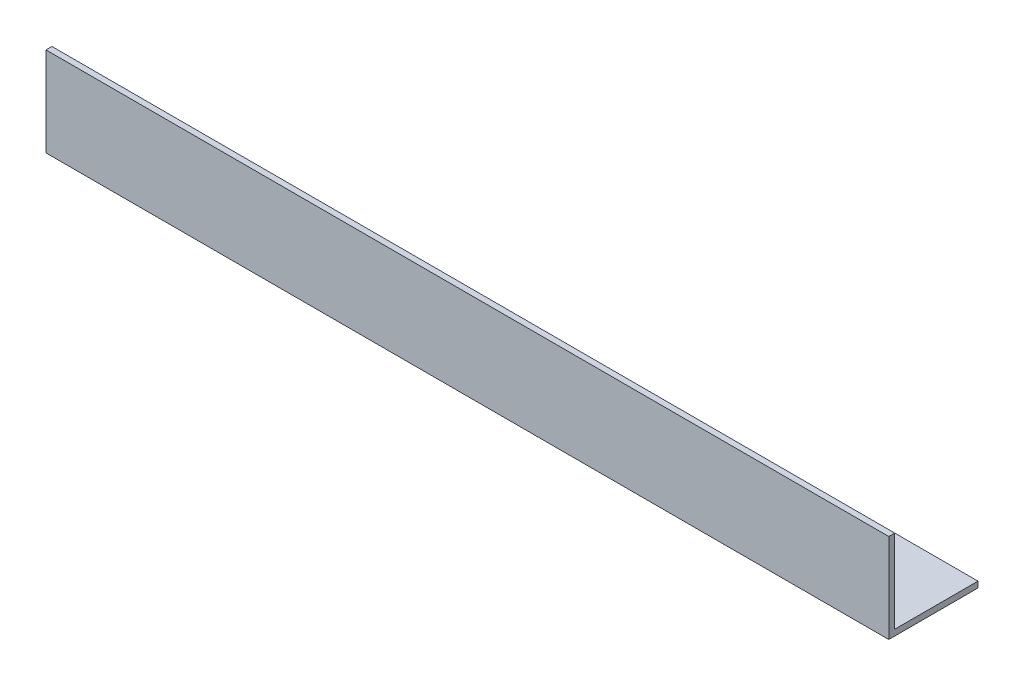
ISO-10303-21;
HEADER;
FILE_DESCRIPTION(('STEP AP214'),'2;1');
FILE_NAME('part.step','',(''),(''),'','','');
FILE_SCHEMA(('AUTOMOTIVE_DESIGN { 1 0 10303 214 1 1 1 1 }'));
ENDSEC;
DATA;
#1=APPLICATION_CONTEXT('core data for automotive mechanical design processes');
#2=APPLICATION_PROTOCOL_DEFINITION('international standard','automotive_design',2000,#1);
#3=PRODUCT_CONTEXT('',#1,'mechanical');
#4=PRODUCT('Part','Part','',(#3));
#5=PRODUCT_RELATED_PRODUCT_CATEGORY('part','',(#4));
#6=PRODUCT_DEFINITION_FORMATION('','',#4);
#7=PRODUCT_DEFINITION_CONTEXT('part definition',#1,'design');
#8=PRODUCT_DEFINITION('design','',#6,#7);
#9=PRODUCT_DEFINITION_SHAPE('','',#8);
#10=(LENGTH_UNIT() NAMED_UNIT(*) SI_UNIT(.MILLI.,.METRE.));
#11=(NAMED_UNIT(*) PLANE_ANGLE_UNIT() SI_UNIT($,.RADIAN.));
#12=(NAMED_UNIT(*) SI_UNIT($,.STERADIAN.) SOLID_ANGLE_UNIT());
#13=UNCERTAINTY_MEASURE_WITH_UNIT(LENGTH_MEASURE(1.E-05),#10,'distance_accuracy_value','');
#14=(GEOMETRIC_REPRESENTATION_CONTEXT(3) GLOBAL_UNCERTAINTY_ASSIGNED_CONTEXT((#13)) GLOBAL_UNIT_ASSIGNED_CONTEXT((#10,
#11,#12)) REPRESENTATION_CONTEXT('',''));
#15=CARTESIAN_POINT('',(0.,0.,0.));
#16=DIRECTION('',(0.,0.,1.));
#17=DIRECTION('',(1.,0.,0.));
#18=AXIS2_PLACEMENT_3D('',#15,#16,#17);
#19=CARTESIAN_POINT('',(425.,0.,0.));
#20=DIRECTION('',(0.,1.,0.));
#21=DIRECTION('',(0.,0.,1.));
#22=AXIS2_PLACEMENT_3D('',#19,#20,#21);
#23=PLANE('',#22);
#24=DIRECTION('',(0.,0.,-1.));
#25=VECTOR('',#24,1.);
#26=CARTESIAN_POINT('',(0.,0.,0.));
#27=LINE('',#26,#25);
#28=CARTESIAN_POINT('',(0.,0.,0.));
#29=VERTEX_POINT('',#28);
#30=CARTESIAN_POINT('',(0.,0.,-45.));
#31=VERTEX_POINT('',#30);
#32=EDGE_CURVE('E116',#29,#31,#27,.T.);
#33=ORIENTED_EDGE('',*,*,#32,.T.);
#34=DIRECTION('',(-1.,0.,0.));
#35=VECTOR('',#34,1.);
#36=CARTESIAN_POINT('',(425.,0.,-45.));
#37=LINE('',#36,#35);
#38=CARTESIAN_POINT('',(425.,0.,-45.));
#39=VERTEX_POINT('',#38);
#40=EDGE_CURVE('E11',#39,#31,#37,.T.);
#41=ORIENTED_EDGE('',*,*,#40,.F.);
#42=DIRECTION('',(0.,0.,-1.));
#43=VECTOR('',#42,1.);
#44=CARTESIAN_POINT('',(425.,0.,0.));
#45=LINE('',#44,#43);
#46=CARTESIAN_POINT('',(425.,0.,0.));
#47=VERTEX_POINT('',#46);
#48=EDGE_CURVE('E81',#47,#39,#45,.T.);
#49=ORIENTED_EDGE('',*,*,#48,.F.);
#50=DIRECTION('',(-1.,0.,0.));
#51=VECTOR('',#50,1.);
#52=CARTESIAN_POINT('',(425.,0.,0.));
#53=LINE('',#52,#51);
#54=EDGE_CURVE('E112',#47,#29,#53,.T.);
#55=ORIENTED_EDGE('',*,*,#54,.T.);
#56=EDGE_LOOP('',(#33,#41,#49,#55));
#57=FACE_BOUND('',#56,.T.);
#58=ADVANCED_FACE('F35',(#57),#23,.F.);
#59=CARTESIAN_POINT('',(425.,3.,-45.));
#60=DIRECTION('',(0.,0.,-1.));
#61=DIRECTION('',(-1.,0.,0.));
#62=AXIS2_PLACEMENT_3D('',#59,#60,#61);
#63=PLANE('',#62);
#64=DIRECTION('',(0.,-1.,0.));
#65=VECTOR('',#64,1.);
#66=CARTESIAN_POINT('',(0.,3.,-45.));
#67=LINE('',#66,#65);
#68=CARTESIAN_POINT('',(0.,3.,-45.));
#69=VERTEX_POINT('',#68);
#70=EDGE_CURVE('E119',#69,#31,#67,.T.);
#71=ORIENTED_EDGE('',*,*,#70,.F.);
#72=DIRECTION('',(-1.,0.,0.));
#73=VECTOR('',#72,1.);
#74=CARTESIAN_POINT('',(425.,3.,-45.));
#75=LINE('',#74,#73);
#76=CARTESIAN_POINT('',(425.,3.,-45.));
#77=VERTEX_POINT('',#76);
#78=EDGE_CURVE('E43',#77,#69,#75,.T.);
#79=ORIENTED_EDGE('',*,*,#78,.F.);
#80=DIRECTION('',(0.,-1.,0.));
#81=VECTOR('',#80,1.);
#82=CARTESIAN_POINT('',(425.,3.,-45.));
#83=LINE('',#82,#81);
#84=EDGE_CURVE('E205',#77,#39,#83,.T.);
#85=ORIENTED_EDGE('',*,*,#84,.T.);
#86=ORIENTED_EDGE('',*,*,#40,.T.);
#87=EDGE_LOOP('',(#71,#79,#85,#86));
#88=FACE_BOUND('',#87,.T.);
#89=ADVANCED_FACE('F137',(#88),#63,.T.);
#90=CARTESIAN_POINT('',(425.,3.,0.));
#91=DIRECTION('',(0.,1.,0.));
#92=DIRECTION('',(0.,0.,1.));
#93=AXIS2_PLACEMENT_3D('',#90,#91,#92);
#94=PLANE('',#93);
#95=DIRECTION('',(0.,0.,-1.));
#96=VECTOR('',#95,1.);
#97=CARTESIAN_POINT('',(0.,3.,0.));
#98=LINE('',#97,#96);
#99=CARTESIAN_POINT('',(0.,3.,-3.));
#100=VERTEX_POINT('',#99);
#101=EDGE_CURVE('E122',#100,#69,#98,.T.);
#102=ORIENTED_EDGE('',*,*,#101,.F.);
#103=DIRECTION('',(-1.,0.,0.));
#104=VECTOR('',#103,1.);
#105=CARTESIAN_POINT('',(425.,3.,-3.));
#106=LINE('',#105,#104);
#107=CARTESIAN_POINT('',(425.,3.,-3.));
#108=VERTEX_POINT('',#107);
#109=EDGE_CURVE('E102',#108,#100,#106,.T.);
#110=ORIENTED_EDGE('',*,*,#109,.F.);
#111=DIRECTION('',(0.,0.,-1.));
#112=VECTOR('',#111,1.);
#113=CARTESIAN_POINT('',(425.,3.,0.));
#114=LINE('',#113,#112);
#115=EDGE_CURVE('E108',#108,#77,#114,.T.);
#116=ORIENTED_EDGE('',*,*,#115,.T.);
#117=ORIENTED_EDGE('',*,*,#78,.T.);
#118=EDGE_LOOP('',(#102,#110,#116,#117));
#119=FACE_BOUND('',#118,.T.);
#120=ADVANCED_FACE('F134',(#119),#94,.T.);
#121=CARTESIAN_POINT('',(425.,0.,-3.));
#122=DIRECTION('',(0.,0.,-1.));
#123=DIRECTION('',(-1.,0.,0.));
#124=AXIS2_PLACEMENT_3D('',#121,#122,#123);
#125=PLANE('',#124);
#126=DIRECTION('',(0.,1.,0.));
#127=VECTOR('',#126,1.);
#128=CARTESIAN_POINT('',(0.,0.,-3.));
#129=LINE('',#128,#127);
#130=CARTESIAN_POINT('',(0.,45.,-3.));
#131=VERTEX_POINT('',#130);
#132=EDGE_CURVE('E97',#131,#100,#129,.F.);
#133=ORIENTED_EDGE('',*,*,#132,.F.);
#134=DIRECTION('',(-1.,0.,0.));
#135=VECTOR('',#134,1.);
#136=CARTESIAN_POINT('',(425.,45.,-3.));
#137=LINE('',#136,#135);
#138=CARTESIAN_POINT('',(425.,45.,-3.));
#139=VERTEX_POINT('',#138);
#140=EDGE_CURVE('E92',#139,#131,#137,.T.);
#141=ORIENTED_EDGE('',*,*,#140,.F.);
#142=DIRECTION('',(0.,1.,0.));
#143=VECTOR('',#142,1.);
#144=CARTESIAN_POINT('',(425.,0.,-3.));
#145=LINE('',#144,#143);
#146=EDGE_CURVE('E95',#139,#108,#145,.F.);
#147=ORIENTED_EDGE('',*,*,#146,.T.);
#148=ORIENTED_EDGE('',*,*,#109,.T.);
#149=EDGE_LOOP('',(#133,#141,#147,#148));
#150=FACE_BOUND('',#149,.T.);
#151=ADVANCED_FACE('F94',(#150),#125,.T.);
#152=CARTESIAN_POINT('',(425.,45.,0.));
#153=DIRECTION('',(0.,1.,0.));
#154=DIRECTION('',(0.,0.,1.));
#155=AXIS2_PLACEMENT_3D('',#152,#153,#154);
#156=PLANE('',#155);
#157=DIRECTION('',(0.,0.,-1.));
#158=VECTOR('',#157,1.);
#159=CARTESIAN_POINT('',(0.,45.,0.));
#160=LINE('',#159,#158);
#161=CARTESIAN_POINT('',(0.,45.,0.));
#162=VERTEX_POINT('',#161);
#163=EDGE_CURVE('E126',#162,#131,#160,.T.);
#164=ORIENTED_EDGE('',*,*,#163,.F.);
#165=DIRECTION('',(-1.,0.,0.));
#166=VECTOR('',#165,1.);
#167=CARTESIAN_POINT('',(425.,45.,0.));
#168=LINE('',#167,#166);
#169=CARTESIAN_POINT('',(425.,45.,0.));
#170=VERTEX_POINT('',#169);
#171=EDGE_CURVE('E72',#170,#162,#168,.T.);
#172=ORIENTED_EDGE('',*,*,#171,.F.);
#173=DIRECTION('',(0.,0.,-1.));
#174=VECTOR('',#173,1.);
#175=CARTESIAN_POINT('',(425.,45.,0.));
#176=LINE('',#175,#174);
#177=EDGE_CURVE('E106',#170,#139,#176,.T.);
#178=ORIENTED_EDGE('',*,*,#177,.T.);
#179=ORIENTED_EDGE('',*,*,#140,.T.);
#180=EDGE_LOOP('',(#164,#172,#178,#179));
#181=FACE_BOUND('',#180,.T.);
#182=ADVANCED_FACE('F110',(#181),#156,.T.);
#183=CARTESIAN_POINT('',(425.,0.,0.));
#184=DIRECTION('',(0.,0.,-1.));
#185=DIRECTION('',(-1.,0.,0.));
#186=AXIS2_PLACEMENT_3D('',#183,#184,#185);
#187=PLANE('',#186);
#188=DIRECTION('',(0.,-1.,0.));
#189=VECTOR('',#188,1.);
#190=CARTESIAN_POINT('',(0.,0.,0.));
#191=LINE('',#190,#189);
#192=EDGE_CURVE('E75',#162,#29,#191,.T.);
#193=ORIENTED_EDGE('',*,*,#192,.T.);
#194=ORIENTED_EDGE('',*,*,#54,.F.);
#195=DIRECTION('',(0.,-1.,0.));
#196=VECTOR('',#195,1.);
#197=CARTESIAN_POINT('',(425.,0.,0.));
#198=LINE('',#197,#196);
#199=EDGE_CURVE('E51',#170,#47,#198,.T.);
#200=ORIENTED_EDGE('',*,*,#199,.F.);
#201=ORIENTED_EDGE('',*,*,#171,.T.);
#202=EDGE_LOOP('',(#193,#194,#200,#201));
#203=FACE_BOUND('',#202,.T.);
#204=ADVANCED_FACE('F142',(#203),#187,.F.);
#205=CARTESIAN_POINT('',(425.,0.,0.));
#206=DIRECTION('',(-1.,0.,0.));
#207=DIRECTION('',(0.,0.,1.));
#208=AXIS2_PLACEMENT_3D('',#205,#206,#207);
#209=PLANE('',#208);
#210=ORIENTED_EDGE('',*,*,#48,.T.);
#211=ORIENTED_EDGE('',*,*,#84,.F.);
#212=ORIENTED_EDGE('',*,*,#115,.F.);
#213=ORIENTED_EDGE('',*,*,#146,.F.);
#214=ORIENTED_EDGE('',*,*,#177,.F.);
#215=ORIENTED_EDGE('',*,*,#199,.T.);
#216=EDGE_LOOP('',(#210,#211,#212,#213,#214,#215));
#217=FACE_BOUND('',#216,.T.);
#218=ADVANCED_FACE('F105',(#217),#209,.F.);
#219=CARTESIAN_POINT('',(0.,0.,0.));
#220=DIRECTION('',(-1.,0.,0.));
#221=DIRECTION('',(0.,0.,1.));
#222=AXIS2_PLACEMENT_3D('',#219,#220,#221);
#223=PLANE('',#222);
#224=ORIENTED_EDGE('',*,*,#32,.F.);
#225=ORIENTED_EDGE('',*,*,#192,.F.);
#226=ORIENTED_EDGE('',*,*,#163,.T.);
#227=ORIENTED_EDGE('',*,*,#132,.T.);
#228=ORIENTED_EDGE('',*,*,#101,.T.);
#229=ORIENTED_EDGE('',*,*,#70,.T.);
#230=EDGE_LOOP('',(#224,#225,#226,#227,#228,#229));
#231=FACE_BOUND('',#230,.T.);
#232=ADVANCED_FACE('F140',(#231),#223,.T.);
#233=CLOSED_SHELL('',(#58,#89,#120,#151,#182,#204,#218,#232));
#234=MANIFOLD_SOLID_BREP('B2',#233);
#235=ADVANCED_BREP_SHAPE_REPRESENTATION('',(#18,#234),#14);
#236=SHAPE_DEFINITION_REPRESENTATION(#9,#235);
ENDSEC;
END-ISO-10303-21;
